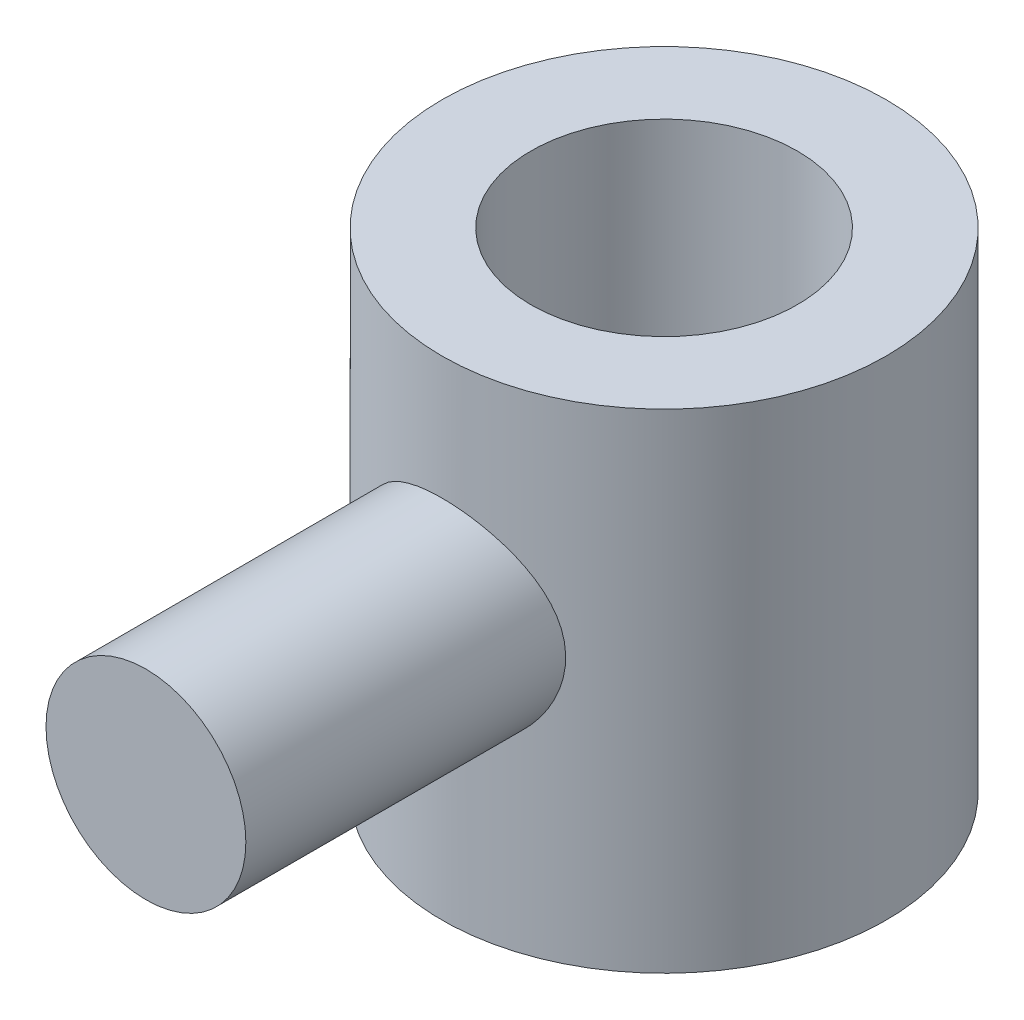
ISO-10303-21;
HEADER;
FILE_DESCRIPTION(('STEP AP214'),'2;1');
FILE_NAME('part.step','',(''),(''),'','','');
FILE_SCHEMA(('AUTOMOTIVE_DESIGN { 1 0 10303 214 1 1 1 1 }'));
ENDSEC;
DATA;
#1=APPLICATION_CONTEXT('core data for automotive mechanical design processes');
#2=APPLICATION_PROTOCOL_DEFINITION('international standard','automotive_design',2000,#1);
#3=PRODUCT_CONTEXT('',#1,'mechanical');
#4=PRODUCT('Part','Part','',(#3));
#5=PRODUCT_RELATED_PRODUCT_CATEGORY('part','',(#4));
#6=PRODUCT_DEFINITION_FORMATION('','',#4);
#7=PRODUCT_DEFINITION_CONTEXT('part definition',#1,'design');
#8=PRODUCT_DEFINITION('design','',#6,#7);
#9=PRODUCT_DEFINITION_SHAPE('','',#8);
#10=(LENGTH_UNIT() NAMED_UNIT(*) SI_UNIT(.MILLI.,.METRE.));
#11=(NAMED_UNIT(*) PLANE_ANGLE_UNIT() SI_UNIT($,.RADIAN.));
#12=(NAMED_UNIT(*) SI_UNIT($,.STERADIAN.) SOLID_ANGLE_UNIT());
#13=UNCERTAINTY_MEASURE_WITH_UNIT(LENGTH_MEASURE(1.E-05),#10,'distance_accuracy_value','');
#14=(GEOMETRIC_REPRESENTATION_CONTEXT(3) GLOBAL_UNCERTAINTY_ASSIGNED_CONTEXT((#13)) GLOBAL_UNIT_ASSIGNED_CONTEXT((#10,
#11,#12)) REPRESENTATION_CONTEXT('',''));
#15=CARTESIAN_POINT('',(0.,0.,0.));
#16=DIRECTION('',(0.,0.,1.));
#17=DIRECTION('',(1.,0.,0.));
#18=AXIS2_PLACEMENT_3D('',#15,#16,#17);
#19=CARTESIAN_POINT('',(0.,500.,0.));
#20=DIRECTION('',(0.,-1.,0.));
#21=DIRECTION('',(0.,0.,-1.));
#22=AXIS2_PLACEMENT_3D('',#19,#20,#21);
#23=CYLINDRICAL_SURFACE('',#22,150.);
#24=CARTESIAN_POINT('',(-67.5,249.430268713618,133.954283246188));
#25=CARTESIAN_POINT('',(-67.5000008326763,248.537493146786,133.95428256527));
#26=CARTESIAN_POINT('',(-67.4822838444825,247.644739427439,133.963214812779));
#27=CARTESIAN_POINT('',(-67.4114708555824,245.860899035577,133.998862621561));
#28=CARTESIAN_POINT('',(-67.3583715886136,244.969812524584,134.025579824626));
#29=CARTESIAN_POINT('',(-67.2169225255251,243.190714888631,134.096575571163));
#30=CARTESIAN_POINT('',(-67.1285556834543,242.302705460579,134.140862606637));
#31=CARTESIAN_POINT('',(-66.9168344860269,240.531810179599,134.246606128988));
#32=CARTESIAN_POINT('',(-66.7934767177561,239.648924835035,134.308064290678));
#33=CARTESIAN_POINT('',(-66.5118447132549,237.888121276648,134.447756629059));
#34=CARTESIAN_POINT('',(-66.3534958933206,237.010217844584,134.526026630195));
#35=CARTESIAN_POINT('',(-66.0024944342647,235.262882240847,134.698585588694));
#36=CARTESIAN_POINT('',(-65.809841506127,234.393450140611,134.792874681019));
#37=CARTESIAN_POINT('',(-65.3907906353305,232.664664019043,134.996662042945));
#38=CARTESIAN_POINT('',(-65.1643962905709,231.80530893371,135.106158690856));
#39=CARTESIAN_POINT('',(-64.6784646946706,230.098071525344,135.339457748333));
#40=CARTESIAN_POINT('',(-64.41893016765,229.250188265656,135.463258981983));
#41=CARTESIAN_POINT('',(-63.8685901674516,227.570937389778,135.723599343244));
#42=CARTESIAN_POINT('',(-63.577930677056,226.739512620725,135.860078640081));
#43=CARTESIAN_POINT('',(-62.9650812945015,225.090544039616,136.145189913987));
#44=CARTESIAN_POINT('',(-62.6428930586807,224.272999501016,136.293821252592));
#45=CARTESIAN_POINT('',(-61.9676794495249,222.652913452877,136.602139177881));
#46=CARTESIAN_POINT('',(-61.6146557472794,221.850371133168,136.761825165376));
#47=CARTESIAN_POINT('',(-60.8784209658434,220.261191347782,137.09113931986));
#48=CARTESIAN_POINT('',(-60.4952038788753,219.474557086766,137.260769463777));
#49=CARTESIAN_POINT('',(-59.3017091544486,217.140810293394,137.782660152531));
#50=CARTESIAN_POINT('',(-58.4472180090441,215.61896734844,138.148091748266));
#51=CARTESIAN_POINT('',(-56.6262211961353,212.650468730515,138.904436826348));
#52=CARTESIAN_POINT('',(-55.659707725466,211.203818305426,139.295352082985));
#53=CARTESIAN_POINT('',(-54.0965580283273,209.048713550434,139.906766456673));
#54=CARTESIAN_POINT('',(-53.5378414482856,208.310866476663,140.121644421191));
#55=CARTESIAN_POINT('',(-52.3911230077239,206.859441596281,140.554422405549));
#56=CARTESIAN_POINT('',(-51.8031279077831,206.14585825049,140.772321719434));
#57=CARTESIAN_POINT('',(-50.5985142086075,204.743640238507,141.209776456781));
#58=CARTESIAN_POINT('',(-49.9818921622595,204.055008594744,141.429332077008));
#59=CARTESIAN_POINT('',(-48.7209352859788,202.703672967633,141.868659186171));
#60=CARTESIAN_POINT('',(-48.0765987628332,202.040970573167,142.088430687492));
#61=CARTESIAN_POINT('',(-46.1027995663635,200.092657401645,142.746119139904));
#62=CARTESIAN_POINT('',(-44.7327587238547,198.84708675142,143.182332472938));
#63=CARTESIAN_POINT('',(-41.8922129431516,196.470636904243,144.039035610492));
#64=CARTESIAN_POINT('',(-40.4217058505996,195.339760168035,144.459525077537));
#65=CARTESIAN_POINT('',(-37.3082951785758,193.143894540993,145.295636311015));
#66=CARTESIAN_POINT('',(-35.6603991873712,192.085428518547,145.709857669577));
#67=CARTESIAN_POINT('',(-32.2713934178969,190.112040401805,146.497725314539));
#68=CARTESIAN_POINT('',(-30.5302794841611,189.197124713847,146.871369789853));
#69=CARTESIAN_POINT('',(-26.9669665569396,187.519781284594,147.567192050594));
#70=CARTESIAN_POINT('',(-25.1448002038048,186.757292827449,147.889390318091));
#71=CARTESIAN_POINT('',(-21.4319925384541,185.392541113493,148.472891995428));
#72=CARTESIAN_POINT('',(-19.5413569453875,184.790264509299,148.734200477822));
#73=CARTESIAN_POINT('',(-15.8207819238862,183.78392266026,149.174396682203));
#74=CARTESIAN_POINT('',(-13.9939241401633,183.370196246582,149.357263262055));
#75=CARTESIAN_POINT('',(-10.3068435953677,182.695489294345,149.656904776067));
#76=CARTESIAN_POINT('',(-8.4466220494341,182.434503204438,149.773682112237));
#77=CARTESIAN_POINT('',(-4.70860046954224,182.068525608735,149.937745966496));
#78=CARTESIAN_POINT('',(-2.83080786723069,181.963470908877,149.985060635523));
#79=CARTESIAN_POINT('',(0.927404117500939,181.910485503029,150.008901060749));
#80=CARTESIAN_POINT('',(2.80782337300867,181.962547451366,149.985430126386));
#81=CARTESIAN_POINT('',(6.42260693944264,182.213852949321,149.872563949728));
#82=CARTESIAN_POINT('',(8.15787715778957,182.402403621297,149.787958931061));
#83=CARTESIAN_POINT('',(11.6047747983628,182.912495211155,149.560395979559));
#84=CARTESIAN_POINT('',(13.3164035557918,183.234028586553,149.41744135619));
#85=CARTESIAN_POINT('',(16.7045425414091,184.006818840696,149.076683873333));
#86=CARTESIAN_POINT('',(18.3810515974374,184.458080041877,148.878879186289));
#87=CARTESIAN_POINT('',(21.6883086761201,185.486025665871,148.433156169328));
#88=CARTESIAN_POINT('',(23.3190552164964,186.062714146072,148.185236218274));
#89=CARTESIAN_POINT('',(26.5494393629683,187.346103750633,147.640952378063));
#90=CARTESIAN_POINT('',(28.1482331553222,188.054639714878,147.34391237164));
#91=CARTESIAN_POINT('',(31.2798908500518,189.589982597205,146.711011200824));
#92=CARTESIAN_POINT('',(32.8127546647947,190.416789672483,146.375149984833));
#93=CARTESIAN_POINT('',(35.8052103559433,192.182942335012,145.672063453933));
#94=CARTESIAN_POINT('',(37.2647814828593,193.122319539315,145.304829335817));
#95=CARTESIAN_POINT('',(40.1033516259816,195.107426607687,144.547153543892));
#96=CARTESIAN_POINT('',(41.4823466724262,196.153161704772,144.156710728563));
#97=CARTESIAN_POINT('',(44.2607882815629,198.433054787761,143.32916246831));
#98=CARTESIAN_POINT('',(45.6529953238308,199.675599104993,142.890826818739));
#99=CARTESIAN_POINT('',(48.3289268113948,202.270551816382,142.008099665415));
#100=CARTESIAN_POINT('',(49.6126457952935,203.62296573477,141.563707858097));
#101=CARTESIAN_POINT('',(52.065293179102,206.431058830867,140.68015252956));
#102=CARTESIAN_POINT('',(53.2341635931132,207.886789539863,140.240991746764));
#103=CARTESIAN_POINT('',(55.4495255462722,210.893439976775,139.379922555201));
#104=CARTESIAN_POINT('',(56.4960151293858,212.444361225534,138.958014422255));
#105=CARTESIAN_POINT('',(58.5026092768649,215.703213812511,138.125580508572));
#106=CARTESIAN_POINT('',(59.4569366512797,217.415045157835,137.716358852738));
#107=CARTESIAN_POINT('',(61.2166176101649,220.923650741807,136.943236468426));
#108=CARTESIAN_POINT('',(62.0219650844702,222.720428460598,136.579337598988));
#109=CARTESIAN_POINT('',(63.4750831432927,226.385803740525,135.910095013477));
#110=CARTESIAN_POINT('',(64.1229631300543,228.254350388203,135.604710675198));
#111=CARTESIAN_POINT('',(65.2542208671406,232.050457747337,135.063987665248));
#112=CARTESIAN_POINT('',(65.7376162735064,233.978012100585,134.828641475909));
#113=CARTESIAN_POINT('',(66.5049294800848,237.736081485106,134.451714533259));
#114=CARTESIAN_POINT('',(66.8006739924735,239.563632129729,134.304616421705));
#115=CARTESIAN_POINT('',(67.241174255053,243.241285768641,134.084621288672));
#116=CARTESIAN_POINT('',(67.3859374073781,245.091387652815,134.011720629534));
#117=CARTESIAN_POINT('',(67.5225018347605,248.797930443063,133.942964011798));
#118=CARTESIAN_POINT('',(67.5143629888812,250.654368582991,133.947077892974));
#119=CARTESIAN_POINT('',(67.3453766521641,254.358454921758,134.032120227171));
#120=CARTESIAN_POINT('',(67.1845355181657,256.206103483282,134.113045482613));
#121=CARTESIAN_POINT('',(66.7313090415414,259.729809845312,134.339086588567));
#122=CARTESIAN_POINT('',(66.4505125169154,261.407741556423,134.478531663246));
#123=CARTESIAN_POINT('',(65.764644569444,264.731949755306,134.815271155798));
#124=CARTESIAN_POINT('',(65.3595811749078,266.378228280746,135.012561836495));
#125=CARTESIAN_POINT('',(64.4290597217224,269.629431436519,135.459079364661));
#126=CARTESIAN_POINT('',(63.9035788039241,271.234348150605,135.708316072354));
#127=CARTESIAN_POINT('',(62.7368546247763,274.39370600598,136.251608587531));
#128=CARTESIAN_POINT('',(62.0956052682431,275.948144484514,136.545666754727));
#129=CARTESIAN_POINT('',(60.6708612157075,279.067538943268,137.1848501183));
#130=CARTESIAN_POINT('',(59.8822579608253,280.629811202529,137.531679622974));
#131=CARTESIAN_POINT('',(58.1897484190341,283.683008915591,138.256284779818));
#132=CARTESIAN_POINT('',(57.2858400522005,285.173933081715,138.634060990176));
#133=CARTESIAN_POINT('',(55.368013261819,288.078198857121,139.411096014587));
#134=CARTESIAN_POINT('',(54.3540515917387,289.491509636525,139.810363242455));
#135=CARTESIAN_POINT('',(52.2219618712083,292.233696705631,140.620650296249));
#136=CARTESIAN_POINT('',(51.1038283674172,293.562568568868,141.031670736668));
#137=CARTESIAN_POINT('',(48.6544645445418,296.255716430141,141.89640777698));
#138=CARTESIAN_POINT('',(47.3130890666433,297.610707967158,142.350362576389));
#139=CARTESIAN_POINT('',(44.5187597351315,300.203917529499,143.248852313308));
#140=CARTESIAN_POINT('',(43.0657988188683,301.442128152263,143.693386652286));
#141=CARTESIAN_POINT('',(40.0559884082882,303.794010276416,144.561307131399));
#142=CARTESIAN_POINT('',(38.4991197616748,304.90765871669,144.984689347483));
#143=CARTESIAN_POINT('',(35.2900866685611,307.002217560728,145.798998321679));
#144=CARTESIAN_POINT('',(33.6379240369508,307.983130491272,146.189925697552));
#145=CARTESIAN_POINT('',(31.0876774666203,309.35314558554,146.745784046497));
#146=CARTESIAN_POINT('',(30.2209819118944,309.794916358901,146.926826176641));
#147=CARTESIAN_POINT('',(28.4673170078951,310.641455714803,147.276646899417));
#148=CARTESIAN_POINT('',(27.5803498498641,311.046228273209,147.44542680936));
#149=CARTESIAN_POINT('',(25.7875068161451,311.817824728903,147.769531949404));
#150=CARTESIAN_POINT('',(24.8816282705136,312.184643223625,147.924855263519));
#151=CARTESIAN_POINT('',(23.052793897236,312.879266470236,148.220870978598));
#152=CARTESIAN_POINT('',(22.1298400439455,313.207075700449,148.361565058787));
#153=CARTESIAN_POINT('',(20.2689169980341,313.822667862622,148.627231702101));
#154=CARTESIAN_POINT('',(19.3309547994277,314.110468865911,148.752211360826));
#155=CARTESIAN_POINT('',(17.4415581680236,314.645342879043,148.985563014675));
#156=CARTESIAN_POINT('',(16.4901252741549,314.892420501112,149.093936890429));
#157=CARTESIAN_POINT('',(14.5756528756489,315.345121869727,149.293256916495));
#158=CARTESIAN_POINT('',(13.6126135417861,315.550746225421,149.384203322899));
#159=CARTESIAN_POINT('',(11.6769762633761,315.919883756976,149.547957287981));
#160=CARTESIAN_POINT('',(10.7043785061533,316.083397756408,149.620765201401));
#161=CARTESIAN_POINT('',(8.82907532511984,316.356517851745,149.742642995658));
#162=CARTESIAN_POINT('',(7.92693307019838,316.469367085431,149.79313592417));
#163=CARTESIAN_POINT('',(6.11798677746691,316.658590911629,149.877917443471));
#164=CARTESIAN_POINT('',(5.211182346288,316.73496237355,149.912204643452));
#165=CARTESIAN_POINT('',(3.39488920660347,316.850982948568,149.964329170787));
#166=CARTESIAN_POINT('',(2.48540091015719,316.890637431772,149.982168903693));
#167=CARTESIAN_POINT('',(0.665297957093835,316.933128678892,150.001285801155));
#168=CARTESIAN_POINT('',(-0.245316803870436,316.935961729185,150.002561295126));
#169=CARTESIAN_POINT('',(-2.06550766741146,316.904796805979,149.988538723472));
#170=CARTESIAN_POINT('',(-2.97508400314516,316.870810148049,149.97324574973));
#171=CARTESIAN_POINT('',(-4.79178887405772,316.766118704834,149.926196873493));
#172=CARTESIAN_POINT('',(-5.69891714179146,316.695410058985,149.894439240077));
#173=CARTESIAN_POINT('',(-7.50876070553596,316.517489632164,149.814681818818));
#174=CARTESIAN_POINT('',(-8.41147650288271,316.410282100739,149.766683921824));
#175=CARTESIAN_POINT('',(-10.2109577942069,316.159660159751,149.654766446824));
#176=CARTESIAN_POINT('',(-11.1077227188776,316.016242335853,149.5908453674));
#177=CARTESIAN_POINT('',(-12.8520077600457,315.701109383483,149.450845807427));
#178=CARTESIAN_POINT('',(-13.6998782287492,315.531020795899,149.37547112505));
#179=CARTESIAN_POINT('',(-15.3872279155804,315.158725292407,149.211099665118));
#180=CARTESIAN_POINT('',(-16.2267063899413,314.95651555602,149.122101691362));
#181=CARTESIAN_POINT('',(-18.730270174414,314.302455967385,148.835465806068));
#182=CARTESIAN_POINT('',(-20.3799932905282,313.803083459364,148.618144581293));
#183=CARTESIAN_POINT('',(-23.6302120057814,312.682301980944,148.136133957169));
#184=CARTESIAN_POINT('',(-25.2307023099895,312.060879936968,147.87143948361));
#185=CARTESIAN_POINT('',(-28.3736360807743,310.701130062948,147.300671166579));
#186=CARTESIAN_POINT('',(-29.9160770013743,309.962797112709,146.994595510876));
#187=CARTESIAN_POINT('',(-33.0039968232681,308.338396786883,146.332984706655));
#188=CARTESIAN_POINT('',(-34.5463834434371,307.447114288132,145.975826980302));
#189=CARTESIAN_POINT('',(-37.5509237190509,305.54921200453,145.231965326055));
#190=CARTESIAN_POINT('',(-39.013075540973,304.542589585558,144.845260723439));
#191=CARTESIAN_POINT('',(-41.8505835137465,302.420069211755,144.051033203429));
#192=CARTESIAN_POINT('',(-43.2259086458779,301.304132563791,143.643502939125));
#193=CARTESIAN_POINT('',(-45.8828174074778,298.969594050923,142.817026525553));
#194=CARTESIAN_POINT('',(-47.1643969976112,297.750987767022,142.398079885439));
#195=CARTESIAN_POINT('',(-49.7276082775977,295.114654684786,141.52435742947));
#196=CARTESIAN_POINT('',(-51.0008363854347,293.688794405897,141.069428060248));
#197=CARTESIAN_POINT('',(-53.4233591273377,290.732174246959,140.169949324178));
#198=CARTESIAN_POINT('',(-54.5726454901179,289.201407377075,139.725400651637));
#199=CARTESIAN_POINT('',(-56.7405396061355,286.042209498963,138.859191213877));
#200=CARTESIAN_POINT('',(-57.7590556921937,284.413711143819,138.437546622091));
#201=CARTESIAN_POINT('',(-59.6569703396732,281.068720815981,137.63033783904));
#202=CARTESIAN_POINT('',(-60.536377122934,279.352234051651,137.244771515977));
#203=CARTESIAN_POINT('',(-61.747632248828,276.714419098294,136.701964297696));
#204=CARTESIAN_POINT('',(-62.1344658872637,275.82168907211,136.526450740028));
#205=CARTESIAN_POINT('',(-62.8699918189295,274.018114274418,136.189308895472));
#206=CARTESIAN_POINT('',(-63.2186884043564,273.107271555097,136.02767904646));
#207=CARTESIAN_POINT('',(-63.8771056143426,271.268748324904,135.719738867268));
#208=CARTESIAN_POINT('',(-64.1868143923557,270.341062793803,135.573433195636));
#209=CARTESIAN_POINT('',(-64.7662063005273,268.47092584874,135.297603377457));
#210=CARTESIAN_POINT('',(-65.0358942651292,267.528476233484,135.168077204217));
#211=CARTESIAN_POINT('',(-65.5337351649032,265.633254733647,134.927409375995));
#212=CARTESIAN_POINT('',(-65.762004102735,264.680519851334,134.816216457347));
#213=CARTESIAN_POINT('',(-66.1771701750528,262.764179115492,134.61291019918));
#214=CARTESIAN_POINT('',(-66.3640725896471,261.800574665898,134.520794424712));
#215=CARTESIAN_POINT('',(-66.6957961522356,259.865035237925,134.356633654329));
#216=CARTESIAN_POINT('',(-66.8406415208185,258.893105387506,134.284577107326));
#217=CARTESIAN_POINT('',(-67.087849861501,256.942684501602,134.161244607299));
#218=CARTESIAN_POINT('',(-67.1902209426351,255.96419475479,134.109964687721));
#219=CARTESIAN_POINT('',(-67.3092729222686,254.522057892321,134.050227505422));
#220=CARTESIAN_POINT('',(-67.3426282572454,254.060065484634,134.033471346843));
#221=CARTESIAN_POINT('',(-67.3998233538734,253.13544247863,134.004719465264));
#222=CARTESIAN_POINT('',(-67.4236651469843,252.672812037747,133.992722725972));
#223=CARTESIAN_POINT('',(-67.4809007134546,251.284063128121,133.96391322082));
#224=CARTESIAN_POINT('',(-67.49999913551,250.357154146464,133.954283953122));
#225=CARTESIAN_POINT('',(-67.5,249.430268713618,133.954283246188));
#226=B_SPLINE_CURVE_WITH_KNOTS('',3,(#24,#25,#26,#27,#28,#29,#30,#31,#32,#33,#34,#35,#36,#37,
#38,#39,#40,#41,#42,#43,#44,#45,#46,#47,#48,#49,#50,#51,#52,#53,#54,#55,#56,#57,#58,#59,#60,#61,
#62,#63,#64,#65,#66,#67,#68,#69,#70,#71,#72,#73,#74,#75,#76,#77,#78,#79,#80,#81,#82,#83,#84,#85,
#86,#87,#88,#89,#90,#91,#92,#93,#94,#95,#96,#97,#98,#99,#100,#101,#102,#103,#104,#105,#106,#107,
#108,#109,#110,#111,#112,#113,#114,#115,#116,#117,#118,#119,#120,#121,#122,#123,#124,#125,#126,
#127,#128,#129,#130,#131,#132,#133,#134,#135,#136,#137,#138,#139,#140,#141,#142,#143,#144,#145,
#146,#147,#148,#149,#150,#151,#152,#153,#154,#155,#156,#157,#158,#159,#160,#161,#162,#163,#164,
#165,#166,#167,#168,#169,#170,#171,#172,#173,#174,#175,#176,#177,#178,#179,#180,#181,#182,#183,
#184,#185,#186,#187,#188,#189,#190,#191,#192,#193,#194,#195,#196,#197,#198,#199,#200,#201,#202,
#203,#204,#205,#206,#207,#208,#209,#210,#211,#212,#213,#214,#215,#216,#217,#218,#219,#220,#221,
#222,#223,#224,#225),.UNSPECIFIED.,.T.,.F.,(4,2,2,2,2,2,2,2,2,2,2,2,2,2,2,2,2,2,2,2,2,2,2,2,2,2,
2,2,2,2,2,2,2,2,2,2,2,2,2,2,2,2,2,2,2,2,2,2,2,2,2,2,2,2,2,2,2,2,2,2,2,2,2,2,2,2,2,2,2,2,2,2,2,2,
2,2,2,2,2,2,2,2,2,2,2,2,2,2,2,2,2,2,2,2,2,2,2,2,2,2,4),(0.,2.67806887753412,5.35638501127972,
8.03599723195455,10.7158709042161,13.4015128139874,16.0871773516769,18.7725557174512,
21.4577134872714,24.1307874118981,26.8037209839869,29.4765097895585,32.1498317672513,
37.4935572020693,42.8376550899732,45.6874001639628,48.5364902394918,51.3859242825151,
54.2355326593468,59.9357474246715,65.6360844614974,71.6340430685443,77.632269275361,
83.6281014462738,89.6234339428122,95.2620535035601,100.900468115913,106.536597032599,
112.172462447487,117.408890982109,122.645022558791,127.881328619769,133.117804092836,
138.433496382823,143.7491957381,149.066391604096,154.383849213198,160.128031215539,
165.872502213712,171.619858793244,177.367307221233,183.366038506481,189.365015765293,
195.359813178777,201.353966897862,206.917913676143,212.481587659039,218.043082856546,
223.60434654487,228.719440105243,233.834203272586,238.949938193273,244.065942534899,
249.412533334345,254.759220591609,260.108016541732,265.45709265603,271.33017808006,
277.203635539962,283.07817860276,288.952609820815,291.920289552662,294.887649998761,
297.855432253853,300.822873473569,303.788969943054,306.754730248837,309.720446970228,
312.686105685359,315.416958735891,318.148046111298,320.878733983616,323.609697257178,
326.339821479137,329.07023277585,331.800326280805,334.530677307515,337.134026942972,
339.737605298484,344.943208598319,350.149369811019,355.355759094261,360.800447866213,
366.245261008224,371.692008421999,377.138990388725,383.027161057344,388.915724431772,
394.808393285801,400.700713732538,403.665817199457,406.630586609813,409.596254709692,
412.561564269979,415.518436163345,418.474930417538,421.429718638734,424.383942482788,
425.774332906093,427.164426275431,429.944814900484),.UNSPECIFIED.);
#227=CARTESIAN_POINT('',(-67.5,249.430268713618,133.954283246188));
#228=VERTEX_POINT('',#227);
#229=EDGE_CURVE('E10',#228,#228,#226,.T.);
#230=ORIENTED_EDGE('',*,*,#229,.F.);
#231=EDGE_LOOP('',(#230));
#232=FACE_BOUND('',#231,.T.);
#233=CARTESIAN_POINT('',(0.,70.,0.));
#234=DIRECTION('',(0.,-1.,0.));
#235=DIRECTION('',(0.,0.,-1.));
#236=AXIS2_PLACEMENT_3D('',#233,#234,#235);
#237=CIRCLE('',#236,150.);
#238=CARTESIAN_POINT('',(0.,70.,-150.));
#239=VERTEX_POINT('',#238);
#240=EDGE_CURVE('E48',#239,#239,#237,.T.);
#241=ORIENTED_EDGE('',*,*,#240,.F.);
#242=EDGE_LOOP('',(#241));
#243=FACE_BOUND('',#242,.T.);
#244=CARTESIAN_POINT('',(0.,400.,0.));
#245=DIRECTION('',(0.,1.,0.));
#246=DIRECTION('',(0.,0.,1.));
#247=AXIS2_PLACEMENT_3D('',#244,#245,#246);
#248=CIRCLE('',#247,150.);
#249=CARTESIAN_POINT('',(0.,400.,150.));
#250=VERTEX_POINT('',#249);
#251=EDGE_CURVE('E56',#250,#250,#248,.T.);
#252=ORIENTED_EDGE('',*,*,#251,.F.);
#253=EDGE_LOOP('',(#252));
#254=FACE_BOUND('',#253,.T.);
#255=ADVANCED_FACE('F37',(#232,#243,#254),#23,.T.);
#256=CARTESIAN_POINT('',(0.,70.,0.));
#257=DIRECTION('',(0.,-1.,0.));
#258=DIRECTION('',(0.,0.,-1.));
#259=AXIS2_PLACEMENT_3D('',#256,#257,#258);
#260=PLANE('',#259);
#261=CARTESIAN_POINT('',(0.,70.,0.));
#262=DIRECTION('',(0.,-1.,0.));
#263=DIRECTION('',(0.,0.,-1.));
#264=AXIS2_PLACEMENT_3D('',#261,#262,#263);
#265=CIRCLE('',#264,90.0000000000001);
#266=CARTESIAN_POINT('',(0.,70.,-90.0000000000001));
#267=VERTEX_POINT('',#266);
#268=EDGE_CURVE('E61',#267,#267,#265,.T.);
#269=ORIENTED_EDGE('',*,*,#268,.F.);
#270=EDGE_LOOP('',(#269));
#271=FACE_BOUND('',#270,.T.);
#272=ORIENTED_EDGE('',*,*,#240,.T.);
#273=EDGE_LOOP('',(#272));
#274=FACE_BOUND('',#273,.T.);
#275=ADVANCED_FACE('F81',(#271,#274),#260,.T.);
#276=CARTESIAN_POINT('',(0.,249.430268713618,350.));
#277=DIRECTION('',(0.,0.,-1.));
#278=DIRECTION('',(-1.,0.,0.));
#279=AXIS2_PLACEMENT_3D('',#276,#277,#278);
#280=CYLINDRICAL_SURFACE('',#279,67.5);
#281=CARTESIAN_POINT('',(0.,249.430268713618,350.));
#282=DIRECTION('',(0.,0.,1.));
#283=DIRECTION('',(1.,0.,0.));
#284=AXIS2_PLACEMENT_3D('',#281,#282,#283);
#285=CIRCLE('',#284,67.5);
#286=CARTESIAN_POINT('',(67.5,249.430268713618,350.));
#287=VERTEX_POINT('',#286);
#288=EDGE_CURVE('E52',#287,#287,#285,.T.);
#289=ORIENTED_EDGE('',*,*,#288,.F.);
#290=EDGE_LOOP('',(#289));
#291=FACE_BOUND('',#290,.T.);
#292=ORIENTED_EDGE('',*,*,#229,.T.);
#293=EDGE_LOOP('',(#292));
#294=FACE_BOUND('',#293,.T.);
#295=ADVANCED_FACE('F86',(#291,#294),#280,.T.);
#296=CARTESIAN_POINT('',(0.,249.430268713618,350.));
#297=DIRECTION('',(0.,0.,1.));
#298=DIRECTION('',(1.,0.,0.));
#299=AXIS2_PLACEMENT_3D('',#296,#297,#298);
#300=PLANE('',#299);
#301=ORIENTED_EDGE('',*,*,#288,.T.);
#302=EDGE_LOOP('',(#301));
#303=FACE_BOUND('',#302,.T.);
#304=ADVANCED_FACE('F78',(#303),#300,.T.);
#305=CARTESIAN_POINT('',(0.,400.,0.));
#306=DIRECTION('',(0.,1.,0.));
#307=DIRECTION('',(0.,0.,1.));
#308=AXIS2_PLACEMENT_3D('',#305,#306,#307);
#309=PLANE('',#308);
#310=CARTESIAN_POINT('',(0.,400.,0.));
#311=DIRECTION('',(0.,-1.,0.));
#312=DIRECTION('',(0.,0.,-1.));
#313=AXIS2_PLACEMENT_3D('',#310,#311,#312);
#314=CIRCLE('',#313,90.0000000000001);
#315=CARTESIAN_POINT('',(0.,400.,-90.0000000000001));
#316=VERTEX_POINT('',#315);
#317=EDGE_CURVE('E64',#316,#316,#314,.T.);
#318=ORIENTED_EDGE('',*,*,#317,.T.);
#319=EDGE_LOOP('',(#318));
#320=FACE_BOUND('',#319,.T.);
#321=ORIENTED_EDGE('',*,*,#251,.T.);
#322=EDGE_LOOP('',(#321));
#323=FACE_BOUND('',#322,.T.);
#324=ADVANCED_FACE('F68',(#320,#323),#309,.T.);
#325=CARTESIAN_POINT('',(0.,400.,0.));
#326=DIRECTION('',(0.,-1.,0.));
#327=DIRECTION('',(0.,0.,-1.));
#328=AXIS2_PLACEMENT_3D('',#325,#326,#327);
#329=CYLINDRICAL_SURFACE('',#328,90.0000000000001);
#330=ORIENTED_EDGE('',*,*,#268,.T.);
#331=EDGE_LOOP('',(#330));
#332=FACE_BOUND('',#331,.T.);
#333=ORIENTED_EDGE('',*,*,#317,.F.);
#334=EDGE_LOOP('',(#333));
#335=FACE_BOUND('',#334,.T.);
#336=ADVANCED_FACE('F71',(#332,#335),#329,.F.);
#337=CLOSED_SHELL('',(#255,#275,#295,#304,#324,#336));
#338=MANIFOLD_SOLID_BREP('B2',#337);
#339=ADVANCED_BREP_SHAPE_REPRESENTATION('',(#18,#338),#14);
#340=SHAPE_DEFINITION_REPRESENTATION(#9,#339);
ENDSEC;
END-ISO-10303-21;
